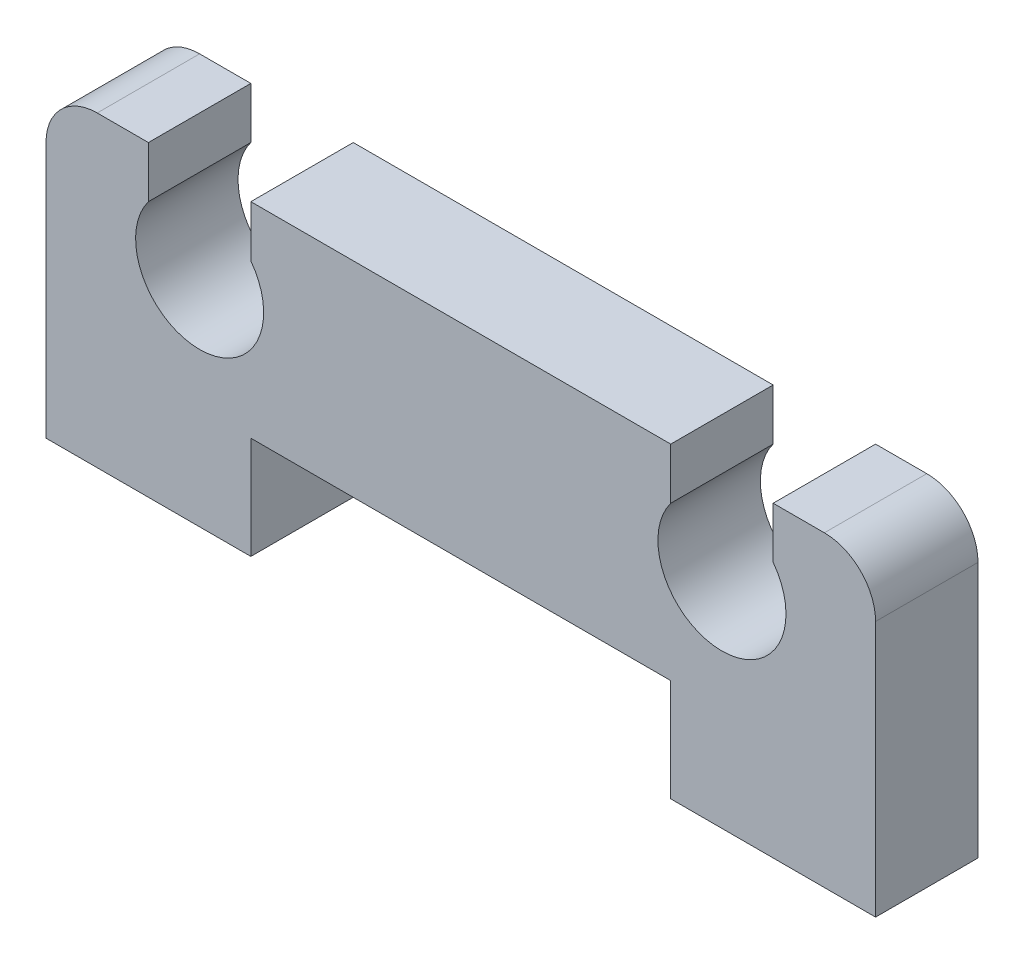
ISO-10303-21;
HEADER;
FILE_DESCRIPTION(('STEP AP214'),'2;1');
FILE_NAME('part.step','',(''),(''),'','','');
FILE_SCHEMA(('AUTOMOTIVE_DESIGN { 1 0 10303 214 1 1 1 1 }'));
ENDSEC;
DATA;
#1=APPLICATION_CONTEXT('core data for automotive mechanical design processes');
#2=APPLICATION_PROTOCOL_DEFINITION('international standard','automotive_design',2000,#1);
#3=PRODUCT_CONTEXT('',#1,'mechanical');
#4=PRODUCT('Part','Part','',(#3));
#5=PRODUCT_RELATED_PRODUCT_CATEGORY('part','',(#4));
#6=PRODUCT_DEFINITION_FORMATION('','',#4);
#7=PRODUCT_DEFINITION_CONTEXT('part definition',#1,'design');
#8=PRODUCT_DEFINITION('design','',#6,#7);
#9=PRODUCT_DEFINITION_SHAPE('','',#8);
#10=(LENGTH_UNIT() NAMED_UNIT(*) SI_UNIT(.MILLI.,.METRE.));
#11=(NAMED_UNIT(*) PLANE_ANGLE_UNIT() SI_UNIT($,.RADIAN.));
#12=(NAMED_UNIT(*) SI_UNIT($,.STERADIAN.) SOLID_ANGLE_UNIT());
#13=UNCERTAINTY_MEASURE_WITH_UNIT(LENGTH_MEASURE(1.E-05),#10,'distance_accuracy_value','');
#14=(GEOMETRIC_REPRESENTATION_CONTEXT(3) GLOBAL_UNCERTAINTY_ASSIGNED_CONTEXT((#13)) GLOBAL_UNIT_ASSIGNED_CONTEXT((#10,
#11,#12)) REPRESENTATION_CONTEXT('',''));
#15=CARTESIAN_POINT('',(0.,0.,0.));
#16=DIRECTION('',(0.,0.,1.));
#17=DIRECTION('',(1.,0.,0.));
#18=AXIS2_PLACEMENT_3D('',#15,#16,#17);
#19=CARTESIAN_POINT('',(4.00000000000054,0.,2.));
#20=DIRECTION('',(-1.,0.,0.));
#21=DIRECTION('',(0.,0.,1.));
#22=AXIS2_PLACEMENT_3D('',#19,#20,#21);
#23=PLANE('',#22);
#24=DIRECTION('',(0.,1.,0.));
#25=VECTOR('',#24,1.);
#26=CARTESIAN_POINT('',(4.00000000000054,0.,0.));
#27=LINE('',#26,#25);
#28=CARTESIAN_POINT('',(4.00000000000054,0.,0.));
#29=VERTEX_POINT('',#28);
#30=CARTESIAN_POINT('',(4.00000000000054,1.99999999999946,0.));
#31=VERTEX_POINT('',#30);
#32=EDGE_CURVE('E189',#29,#31,#27,.T.);
#33=ORIENTED_EDGE('',*,*,#32,.T.);
#34=DIRECTION('',(0.,0.,-1.));
#35=VECTOR('',#34,1.);
#36=CARTESIAN_POINT('',(4.00000000000054,1.99999999999946,2.));
#37=LINE('',#36,#35);
#38=CARTESIAN_POINT('',(4.00000000000054,1.99999999999946,2.));
#39=VERTEX_POINT('',#38);
#40=EDGE_CURVE('E11',#39,#31,#37,.T.);
#41=ORIENTED_EDGE('',*,*,#40,.F.);
#42=DIRECTION('',(0.,1.,0.));
#43=VECTOR('',#42,1.);
#44=CARTESIAN_POINT('',(4.00000000000054,0.,2.));
#45=LINE('',#44,#43);
#46=CARTESIAN_POINT('',(4.00000000000054,0.,2.));
#47=VERTEX_POINT('',#46);
#48=EDGE_CURVE('E223',#47,#39,#45,.T.);
#49=ORIENTED_EDGE('',*,*,#48,.F.);
#50=DIRECTION('',(0.,0.,-1.));
#51=VECTOR('',#50,1.);
#52=CARTESIAN_POINT('',(4.00000000000054,0.,2.));
#53=LINE('',#52,#51);
#54=EDGE_CURVE('E185',#47,#29,#53,.T.);
#55=ORIENTED_EDGE('',*,*,#54,.T.);
#56=EDGE_LOOP('',(#33,#41,#49,#55));
#57=FACE_BOUND('',#56,.T.);
#58=ADVANCED_FACE('F33',(#57),#23,.F.);
#59=CARTESIAN_POINT('',(4.00000000000054,1.99999999999946,2.));
#60=DIRECTION('',(0.,1.,0.));
#61=DIRECTION('',(-1.,0.,0.));
#62=AXIS2_PLACEMENT_3D('',#59,#60,#61);
#63=PLANE('',#62);
#64=DIRECTION('',(1.,0.,0.));
#65=VECTOR('',#64,1.);
#66=CARTESIAN_POINT('',(4.00000000000054,1.99999999999946,0.));
#67=LINE('',#66,#65);
#68=CARTESIAN_POINT('',(12.1999999999995,1.99999999999946,0.));
#69=VERTEX_POINT('',#68);
#70=EDGE_CURVE('E192',#31,#69,#67,.T.);
#71=ORIENTED_EDGE('',*,*,#70,.T.);
#72=DIRECTION('',(0.,0.,-1.));
#73=VECTOR('',#72,1.);
#74=CARTESIAN_POINT('',(12.1999999999995,1.99999999999946,2.));
#75=LINE('',#74,#73);
#76=CARTESIAN_POINT('',(12.1999999999995,1.99999999999946,2.));
#77=VERTEX_POINT('',#76);
#78=EDGE_CURVE('E41',#77,#69,#75,.T.);
#79=ORIENTED_EDGE('',*,*,#78,.F.);
#80=DIRECTION('',(1.,0.,0.));
#81=VECTOR('',#80,1.);
#82=CARTESIAN_POINT('',(4.00000000000054,1.99999999999946,2.));
#83=LINE('',#82,#81);
#84=EDGE_CURVE('E122',#39,#77,#83,.T.);
#85=ORIENTED_EDGE('',*,*,#84,.F.);
#86=ORIENTED_EDGE('',*,*,#40,.T.);
#87=EDGE_LOOP('',(#71,#79,#85,#86));
#88=FACE_BOUND('',#87,.T.);
#89=ADVANCED_FACE('F331',(#88),#63,.F.);
#90=CARTESIAN_POINT('',(12.1999999999995,0.,2.));
#91=DIRECTION('',(1.,0.,0.));
#92=DIRECTION('',(0.,1.,0.));
#93=AXIS2_PLACEMENT_3D('',#90,#91,#92);
#94=PLANE('',#93);
#95=DIRECTION('',(0.,-1.,0.));
#96=VECTOR('',#95,1.);
#97=CARTESIAN_POINT('',(12.1999999999995,0.,0.));
#98=LINE('',#97,#96);
#99=CARTESIAN_POINT('',(12.1999999999995,0.,0.));
#100=VERTEX_POINT('',#99);
#101=EDGE_CURVE('E194',#69,#100,#98,.T.);
#102=ORIENTED_EDGE('',*,*,#101,.T.);
#103=DIRECTION('',(0.,0.,-1.));
#104=VECTOR('',#103,1.);
#105=CARTESIAN_POINT('',(12.1999999999995,0.,2.));
#106=LINE('',#105,#104);
#107=CARTESIAN_POINT('',(12.1999999999995,0.,2.));
#108=VERTEX_POINT('',#107);
#109=EDGE_CURVE('E260',#108,#100,#106,.T.);
#110=ORIENTED_EDGE('',*,*,#109,.F.);
#111=DIRECTION('',(0.,-1.,0.));
#112=VECTOR('',#111,1.);
#113=CARTESIAN_POINT('',(12.1999999999995,0.,2.));
#114=LINE('',#113,#112);
#115=EDGE_CURVE('E268',#77,#108,#114,.T.);
#116=ORIENTED_EDGE('',*,*,#115,.F.);
#117=ORIENTED_EDGE('',*,*,#78,.T.);
#118=EDGE_LOOP('',(#102,#110,#116,#117));
#119=FACE_BOUND('',#118,.T.);
#120=ADVANCED_FACE('F266',(#119),#94,.F.);
#121=CARTESIAN_POINT('',(16.2,0.,2.));
#122=DIRECTION('',(0.,1.,0.));
#123=DIRECTION('',(-1.,0.,0.));
#124=AXIS2_PLACEMENT_3D('',#121,#122,#123);
#125=PLANE('',#124);
#126=DIRECTION('',(1.,0.,0.));
#127=VECTOR('',#126,1.);
#128=CARTESIAN_POINT('',(16.2,0.,0.));
#129=LINE('',#128,#127);
#130=CARTESIAN_POINT('',(16.2,0.,0.));
#131=VERTEX_POINT('',#130);
#132=EDGE_CURVE('E196',#100,#131,#129,.T.);
#133=ORIENTED_EDGE('',*,*,#132,.T.);
#134=DIRECTION('',(0.,0.,-1.));
#135=VECTOR('',#134,1.);
#136=CARTESIAN_POINT('',(16.2,0.,2.));
#137=LINE('',#136,#135);
#138=CARTESIAN_POINT('',(16.2,0.,2.));
#139=VERTEX_POINT('',#138);
#140=EDGE_CURVE('E257',#139,#131,#137,.T.);
#141=ORIENTED_EDGE('',*,*,#140,.F.);
#142=DIRECTION('',(1.,0.,0.));
#143=VECTOR('',#142,1.);
#144=CARTESIAN_POINT('',(16.2,0.,2.));
#145=LINE('',#144,#143);
#146=EDGE_CURVE('E286',#108,#139,#145,.T.);
#147=ORIENTED_EDGE('',*,*,#146,.F.);
#148=ORIENTED_EDGE('',*,*,#109,.T.);
#149=EDGE_LOOP('',(#133,#141,#147,#148));
#150=FACE_BOUND('',#149,.T.);
#151=ADVANCED_FACE('F277',(#150),#125,.F.);
#152=CARTESIAN_POINT('',(16.2,0.,2.));
#153=DIRECTION('',(-1.,0.,0.));
#154=DIRECTION('',(0.,0.,1.));
#155=AXIS2_PLACEMENT_3D('',#152,#153,#154);
#156=PLANE('',#155);
#157=DIRECTION('',(0.,1.,0.));
#158=VECTOR('',#157,1.);
#159=CARTESIAN_POINT('',(16.2,0.,0.));
#160=LINE('',#159,#158);
#161=CARTESIAN_POINT('',(16.2,5.00000000000012,0.));
#162=VERTEX_POINT('',#161);
#163=EDGE_CURVE('E198',#131,#162,#160,.T.);
#164=ORIENTED_EDGE('',*,*,#163,.T.);
#165=DIRECTION('',(0.,0.,-1.));
#166=VECTOR('',#165,1.);
#167=CARTESIAN_POINT('',(16.2,5.00000000000012,2.));
#168=LINE('',#167,#166);
#169=CARTESIAN_POINT('',(16.2,5.00000000000012,2.));
#170=VERTEX_POINT('',#169);
#171=EDGE_CURVE('E254',#170,#162,#168,.T.);
#172=ORIENTED_EDGE('',*,*,#171,.F.);
#173=DIRECTION('',(0.,1.,0.));
#174=VECTOR('',#173,1.);
#175=CARTESIAN_POINT('',(16.2,0.,2.));
#176=LINE('',#175,#174);
#177=EDGE_CURVE('E283',#139,#170,#176,.T.);
#178=ORIENTED_EDGE('',*,*,#177,.F.);
#179=ORIENTED_EDGE('',*,*,#140,.T.);
#180=EDGE_LOOP('',(#164,#172,#178,#179));
#181=FACE_BOUND('',#180,.T.);
#182=ADVANCED_FACE('F281',(#181),#156,.F.);
#183=CARTESIAN_POINT('',(15.2000000000001,5.00000000000012,2.));
#184=DIRECTION('',(0.,0.,-1.));
#185=DIRECTION('',(-1.,0.,0.));
#186=AXIS2_PLACEMENT_3D('',#183,#184,#185);
#187=CYLINDRICAL_SURFACE('',#186,0.99999999999989);
#188=CARTESIAN_POINT('',(15.2000000000001,5.00000000000012,0.));
#189=DIRECTION('',(0.,0.,1.));
#190=DIRECTION('',(-1.,0.,0.));
#191=AXIS2_PLACEMENT_3D('',#188,#189,#190);
#192=CIRCLE('',#191,0.99999999999989);
#193=CARTESIAN_POINT('',(15.2000000000001,6.00000000000001,0.));
#194=VERTEX_POINT('',#193);
#195=EDGE_CURVE('E200',#162,#194,#192,.T.);
#196=ORIENTED_EDGE('',*,*,#195,.T.);
#197=DIRECTION('',(0.,0.,-1.));
#198=VECTOR('',#197,1.);
#199=CARTESIAN_POINT('',(15.2000000000001,6.00000000000001,2.));
#200=LINE('',#199,#198);
#201=CARTESIAN_POINT('',(15.2000000000001,6.00000000000001,2.));
#202=VERTEX_POINT('',#201);
#203=EDGE_CURVE('E251',#202,#194,#200,.T.);
#204=ORIENTED_EDGE('',*,*,#203,.F.);
#205=CARTESIAN_POINT('',(15.2000000000001,5.00000000000012,2.));
#206=DIRECTION('',(0.,0.,1.));
#207=DIRECTION('',(-1.,0.,0.));
#208=AXIS2_PLACEMENT_3D('',#205,#206,#207);
#209=CIRCLE('',#208,0.99999999999989);
#210=EDGE_CURVE('E285',#170,#202,#209,.T.);
#211=ORIENTED_EDGE('',*,*,#210,.F.);
#212=ORIENTED_EDGE('',*,*,#171,.T.);
#213=EDGE_LOOP('',(#196,#204,#211,#212));
#214=FACE_BOUND('',#213,.T.);
#215=ADVANCED_FACE('F344',(#214),#187,.T.);
#216=CARTESIAN_POINT('',(14.2000000000002,6.00000000000001,2.));
#217=DIRECTION('',(0.,-1.,0.));
#218=DIRECTION('',(0.,0.,-1.));
#219=AXIS2_PLACEMENT_3D('',#216,#217,#218);
#220=PLANE('',#219);
#221=DIRECTION('',(-1.,0.,0.));
#222=VECTOR('',#221,1.);
#223=CARTESIAN_POINT('',(14.2000000000002,6.00000000000001,0.));
#224=LINE('',#223,#222);
#225=CARTESIAN_POINT('',(14.2000000000002,6.00000000000001,0.));
#226=VERTEX_POINT('',#225);
#227=EDGE_CURVE('E202',#194,#226,#224,.T.);
#228=ORIENTED_EDGE('',*,*,#227,.T.);
#229=DIRECTION('',(0.,0.,-1.));
#230=VECTOR('',#229,1.);
#231=CARTESIAN_POINT('',(14.2000000000002,6.00000000000001,2.));
#232=LINE('',#231,#230);
#233=CARTESIAN_POINT('',(14.2000000000002,6.00000000000001,2.));
#234=VERTEX_POINT('',#233);
#235=EDGE_CURVE('E248',#234,#226,#232,.T.);
#236=ORIENTED_EDGE('',*,*,#235,.F.);
#237=DIRECTION('',(-1.,0.,0.));
#238=VECTOR('',#237,1.);
#239=CARTESIAN_POINT('',(14.2000000000002,6.00000000000001,2.));
#240=LINE('',#239,#238);
#241=EDGE_CURVE('E288',#202,#234,#240,.T.);
#242=ORIENTED_EDGE('',*,*,#241,.F.);
#243=ORIENTED_EDGE('',*,*,#203,.T.);
#244=EDGE_LOOP('',(#228,#236,#242,#243));
#245=FACE_BOUND('',#244,.T.);
#246=ADVANCED_FACE('F347',(#245),#220,.F.);
#247=CARTESIAN_POINT('',(14.2000000000002,6.00000000000001,2.));
#248=DIRECTION('',(1.,0.,0.));
#249=DIRECTION('',(0.,0.,-1.));
#250=AXIS2_PLACEMENT_3D('',#247,#248,#249);
#251=PLANE('',#250);
#252=DIRECTION('',(0.,-1.,0.));
#253=VECTOR('',#252,1.);
#254=CARTESIAN_POINT('',(14.2000000000002,6.00000000000001,0.));
#255=LINE('',#254,#253);
#256=CARTESIAN_POINT('',(14.2000000000002,5.00000000000012,0.));
#257=VERTEX_POINT('',#256);
#258=EDGE_CURVE('E204',#226,#257,#255,.T.);
#259=ORIENTED_EDGE('',*,*,#258,.T.);
#260=DIRECTION('',(0.,0.,-1.));
#261=VECTOR('',#260,1.);
#262=CARTESIAN_POINT('',(14.2000000000002,5.00000000000012,2.));
#263=LINE('',#262,#261);
#264=CARTESIAN_POINT('',(14.2000000000002,5.00000000000012,2.));
#265=VERTEX_POINT('',#264);
#266=EDGE_CURVE('E245',#265,#257,#263,.T.);
#267=ORIENTED_EDGE('',*,*,#266,.F.);
#268=DIRECTION('',(0.,-1.,0.));
#269=VECTOR('',#268,1.);
#270=CARTESIAN_POINT('',(14.2000000000002,6.00000000000001,2.));
#271=LINE('',#270,#269);
#272=EDGE_CURVE('E294',#234,#265,#271,.T.);
#273=ORIENTED_EDGE('',*,*,#272,.F.);
#274=ORIENTED_EDGE('',*,*,#235,.T.);
#275=EDGE_LOOP('',(#259,#267,#273,#274));
#276=FACE_BOUND('',#275,.T.);
#277=ADVANCED_FACE('F351',(#276),#251,.F.);
#278=CARTESIAN_POINT('',(13.1999999999998,4.25000000000106,2.));
#279=DIRECTION('',(0.,0.,-1.));
#280=DIRECTION('',(-1.,0.,0.));
#281=AXIS2_PLACEMENT_3D('',#278,#279,#280);
#282=CYLINDRICAL_SURFACE('',#281,1.24999999999974);
#283=CARTESIAN_POINT('',(13.1999999999998,4.25000000000106,0.));
#284=DIRECTION('',(0.,0.,-1.));
#285=DIRECTION('',(-1.,0.,0.));
#286=AXIS2_PLACEMENT_3D('',#283,#284,#285);
#287=CIRCLE('',#286,1.24999999999974);
#288=CARTESIAN_POINT('',(12.1999999999995,5.00000000000012,0.));
#289=VERTEX_POINT('',#288);
#290=EDGE_CURVE('E206',#257,#289,#287,.T.);
#291=ORIENTED_EDGE('',*,*,#290,.T.);
#292=DIRECTION('',(0.,0.,-1.));
#293=VECTOR('',#292,1.);
#294=CARTESIAN_POINT('',(12.1999999999995,5.00000000000012,2.));
#295=LINE('',#294,#293);
#296=CARTESIAN_POINT('',(12.1999999999995,5.00000000000012,2.));
#297=VERTEX_POINT('',#296);
#298=EDGE_CURVE('E242',#297,#289,#295,.T.);
#299=ORIENTED_EDGE('',*,*,#298,.F.);
#300=CARTESIAN_POINT('',(13.1999999999998,4.25000000000106,2.));
#301=DIRECTION('',(0.,0.,-1.));
#302=DIRECTION('',(-1.,0.,0.));
#303=AXIS2_PLACEMENT_3D('',#300,#301,#302);
#304=CIRCLE('',#303,1.24999999999974);
#305=EDGE_CURVE('E296',#265,#297,#304,.T.);
#306=ORIENTED_EDGE('',*,*,#305,.F.);
#307=ORIENTED_EDGE('',*,*,#266,.T.);
#308=EDGE_LOOP('',(#291,#299,#306,#307));
#309=FACE_BOUND('',#308,.T.);
#310=ADVANCED_FACE('F355',(#309),#282,.F.);
#311=CARTESIAN_POINT('',(12.1999999999995,6.00000000000001,2.));
#312=DIRECTION('',(-1.,0.,0.));
#313=DIRECTION('',(0.,0.,1.));
#314=AXIS2_PLACEMENT_3D('',#311,#312,#313);
#315=PLANE('',#314);
#316=DIRECTION('',(0.,1.,0.));
#317=VECTOR('',#316,1.);
#318=CARTESIAN_POINT('',(12.1999999999995,6.00000000000001,0.));
#319=LINE('',#318,#317);
#320=CARTESIAN_POINT('',(12.1999999999995,6.00000000000001,0.));
#321=VERTEX_POINT('',#320);
#322=EDGE_CURVE('E208',#289,#321,#319,.T.);
#323=ORIENTED_EDGE('',*,*,#322,.T.);
#324=DIRECTION('',(0.,0.,-1.));
#325=VECTOR('',#324,1.);
#326=CARTESIAN_POINT('',(12.1999999999995,6.00000000000001,2.));
#327=LINE('',#326,#325);
#328=CARTESIAN_POINT('',(12.1999999999995,6.00000000000001,2.));
#329=VERTEX_POINT('',#328);
#330=EDGE_CURVE('E239',#329,#321,#327,.T.);
#331=ORIENTED_EDGE('',*,*,#330,.F.);
#332=DIRECTION('',(0.,1.,0.));
#333=VECTOR('',#332,1.);
#334=CARTESIAN_POINT('',(12.1999999999995,6.00000000000001,2.));
#335=LINE('',#334,#333);
#336=EDGE_CURVE('E298',#297,#329,#335,.T.);
#337=ORIENTED_EDGE('',*,*,#336,.F.);
#338=ORIENTED_EDGE('',*,*,#298,.T.);
#339=EDGE_LOOP('',(#323,#331,#337,#338));
#340=FACE_BOUND('',#339,.T.);
#341=ADVANCED_FACE('F359',(#340),#315,.F.);
#342=CARTESIAN_POINT('',(4.00000000000054,6.00000000000001,2.));
#343=DIRECTION('',(0.,-1.,0.));
#344=DIRECTION('',(1.,0.,0.));
#345=AXIS2_PLACEMENT_3D('',#342,#343,#344);
#346=PLANE('',#345);
#347=DIRECTION('',(-1.,0.,0.));
#348=VECTOR('',#347,1.);
#349=CARTESIAN_POINT('',(4.00000000000054,6.00000000000001,0.));
#350=LINE('',#349,#348);
#351=CARTESIAN_POINT('',(4.00000000000054,6.00000000000001,0.));
#352=VERTEX_POINT('',#351);
#353=EDGE_CURVE('E210',#321,#352,#350,.T.);
#354=ORIENTED_EDGE('',*,*,#353,.T.);
#355=DIRECTION('',(0.,0.,-1.));
#356=VECTOR('',#355,1.);
#357=CARTESIAN_POINT('',(4.00000000000054,6.00000000000001,2.));
#358=LINE('',#357,#356);
#359=CARTESIAN_POINT('',(4.00000000000054,6.00000000000001,2.));
#360=VERTEX_POINT('',#359);
#361=EDGE_CURVE('E236',#360,#352,#358,.T.);
#362=ORIENTED_EDGE('',*,*,#361,.F.);
#363=DIRECTION('',(-1.,0.,0.));
#364=VECTOR('',#363,1.);
#365=CARTESIAN_POINT('',(4.00000000000054,6.00000000000001,2.));
#366=LINE('',#365,#364);
#367=EDGE_CURVE('E300',#329,#360,#366,.T.);
#368=ORIENTED_EDGE('',*,*,#367,.F.);
#369=ORIENTED_EDGE('',*,*,#330,.T.);
#370=EDGE_LOOP('',(#354,#362,#368,#369));
#371=FACE_BOUND('',#370,.T.);
#372=ADVANCED_FACE('F363',(#371),#346,.F.);
#373=CARTESIAN_POINT('',(4.00000000000054,6.00000000000001,2.));
#374=DIRECTION('',(1.,0.,0.));
#375=DIRECTION('',(0.,1.,0.));
#376=AXIS2_PLACEMENT_3D('',#373,#374,#375);
#377=PLANE('',#376);
#378=DIRECTION('',(0.,-1.,0.));
#379=VECTOR('',#378,1.);
#380=CARTESIAN_POINT('',(4.00000000000054,6.00000000000001,0.));
#381=LINE('',#380,#379);
#382=CARTESIAN_POINT('',(4.00000000000055,5.00000000000012,0.));
#383=VERTEX_POINT('',#382);
#384=EDGE_CURVE('E212',#352,#383,#381,.T.);
#385=ORIENTED_EDGE('',*,*,#384,.T.);
#386=DIRECTION('',(0.,0.,-1.));
#387=VECTOR('',#386,1.);
#388=CARTESIAN_POINT('',(4.00000000000055,5.00000000000012,2.));
#389=LINE('',#388,#387);
#390=CARTESIAN_POINT('',(4.00000000000055,5.00000000000012,2.));
#391=VERTEX_POINT('',#390);
#392=EDGE_CURVE('E233',#391,#383,#389,.T.);
#393=ORIENTED_EDGE('',*,*,#392,.F.);
#394=DIRECTION('',(0.,-1.,0.));
#395=VECTOR('',#394,1.);
#396=CARTESIAN_POINT('',(4.00000000000054,6.00000000000001,2.));
#397=LINE('',#396,#395);
#398=EDGE_CURVE('E302',#360,#391,#397,.T.);
#399=ORIENTED_EDGE('',*,*,#398,.F.);
#400=ORIENTED_EDGE('',*,*,#361,.T.);
#401=EDGE_LOOP('',(#385,#393,#399,#400));
#402=FACE_BOUND('',#401,.T.);
#403=ADVANCED_FACE('F367',(#402),#377,.F.);
#404=CARTESIAN_POINT('',(3.00000000000016,4.25000000000105,2.));
#405=DIRECTION('',(0.,0.,-1.));
#406=DIRECTION('',(-1.,0.,0.));
#407=AXIS2_PLACEMENT_3D('',#404,#405,#406);
#408=CYLINDRICAL_SURFACE('',#407,1.24999999999974);
#409=CARTESIAN_POINT('',(3.00000000000016,4.25000000000105,0.));
#410=DIRECTION('',(0.,0.,-1.));
#411=DIRECTION('',(1.,0.,0.));
#412=AXIS2_PLACEMENT_3D('',#409,#410,#411);
#413=CIRCLE('',#412,1.24999999999974);
#414=CARTESIAN_POINT('',(1.99999999999978,5.00000000000012,0.));
#415=VERTEX_POINT('',#414);
#416=EDGE_CURVE('E214',#383,#415,#413,.T.);
#417=ORIENTED_EDGE('',*,*,#416,.T.);
#418=DIRECTION('',(0.,0.,-1.));
#419=VECTOR('',#418,1.);
#420=CARTESIAN_POINT('',(1.99999999999978,5.00000000000012,2.));
#421=LINE('',#420,#419);
#422=CARTESIAN_POINT('',(1.99999999999978,5.00000000000012,2.));
#423=VERTEX_POINT('',#422);
#424=EDGE_CURVE('E230',#423,#415,#421,.T.);
#425=ORIENTED_EDGE('',*,*,#424,.F.);
#426=CARTESIAN_POINT('',(3.00000000000016,4.25000000000105,2.));
#427=DIRECTION('',(0.,0.,-1.));
#428=DIRECTION('',(1.,0.,0.));
#429=AXIS2_PLACEMENT_3D('',#426,#427,#428);
#430=CIRCLE('',#429,1.24999999999974);
#431=EDGE_CURVE('E304',#391,#423,#430,.T.);
#432=ORIENTED_EDGE('',*,*,#431,.F.);
#433=ORIENTED_EDGE('',*,*,#392,.T.);
#434=EDGE_LOOP('',(#417,#425,#432,#433));
#435=FACE_BOUND('',#434,.T.);
#436=ADVANCED_FACE('F371',(#435),#408,.F.);
#437=CARTESIAN_POINT('',(1.99999999999978,6.00000000000001,2.));
#438=DIRECTION('',(-1.,0.,0.));
#439=DIRECTION('',(0.,-1.,0.));
#440=AXIS2_PLACEMENT_3D('',#437,#438,#439);
#441=PLANE('',#440);
#442=DIRECTION('',(0.,1.,0.));
#443=VECTOR('',#442,1.);
#444=CARTESIAN_POINT('',(1.99999999999978,6.00000000000001,0.));
#445=LINE('',#444,#443);
#446=CARTESIAN_POINT('',(1.99999999999978,6.00000000000001,0.));
#447=VERTEX_POINT('',#446);
#448=EDGE_CURVE('E216',#415,#447,#445,.T.);
#449=ORIENTED_EDGE('',*,*,#448,.T.);
#450=DIRECTION('',(0.,0.,-1.));
#451=VECTOR('',#450,1.);
#452=CARTESIAN_POINT('',(1.99999999999978,6.00000000000001,2.));
#453=LINE('',#452,#451);
#454=CARTESIAN_POINT('',(1.99999999999978,6.00000000000001,2.));
#455=VERTEX_POINT('',#454);
#456=EDGE_CURVE('E227',#455,#447,#453,.T.);
#457=ORIENTED_EDGE('',*,*,#456,.F.);
#458=DIRECTION('',(0.,1.,0.));
#459=VECTOR('',#458,1.);
#460=CARTESIAN_POINT('',(1.99999999999978,6.00000000000001,2.));
#461=LINE('',#460,#459);
#462=EDGE_CURVE('E306',#423,#455,#461,.T.);
#463=ORIENTED_EDGE('',*,*,#462,.F.);
#464=ORIENTED_EDGE('',*,*,#424,.T.);
#465=EDGE_LOOP('',(#449,#457,#463,#464));
#466=FACE_BOUND('',#465,.T.);
#467=ADVANCED_FACE('F312',(#466),#441,.F.);
#468=CARTESIAN_POINT('',(1.99999999999978,6.00000000000001,2.));
#469=DIRECTION('',(0.,-1.,0.));
#470=DIRECTION('',(0.,0.,-1.));
#471=AXIS2_PLACEMENT_3D('',#468,#469,#470);
#472=PLANE('',#471);
#473=DIRECTION('',(-1.,0.,0.));
#474=VECTOR('',#473,1.);
#475=CARTESIAN_POINT('',(1.99999999999978,6.00000000000001,0.));
#476=LINE('',#475,#474);
#477=CARTESIAN_POINT('',(0.99999999999989,6.00000000000001,0.));
#478=VERTEX_POINT('',#477);
#479=EDGE_CURVE('E218',#447,#478,#476,.T.);
#480=ORIENTED_EDGE('',*,*,#479,.T.);
#481=DIRECTION('',(0.,0.,-1.));
#482=VECTOR('',#481,1.);
#483=CARTESIAN_POINT('',(0.99999999999989,6.00000000000001,2.));
#484=LINE('',#483,#482);
#485=CARTESIAN_POINT('',(0.99999999999989,6.00000000000001,2.));
#486=VERTEX_POINT('',#485);
#487=EDGE_CURVE('E180',#486,#478,#484,.T.);
#488=ORIENTED_EDGE('',*,*,#487,.F.);
#489=DIRECTION('',(-1.,0.,0.));
#490=VECTOR('',#489,1.);
#491=CARTESIAN_POINT('',(1.99999999999978,6.00000000000001,2.));
#492=LINE('',#491,#490);
#493=EDGE_CURVE('E171',#455,#486,#492,.T.);
#494=ORIENTED_EDGE('',*,*,#493,.F.);
#495=ORIENTED_EDGE('',*,*,#456,.T.);
#496=EDGE_LOOP('',(#480,#488,#494,#495));
#497=FACE_BOUND('',#496,.T.);
#498=ADVANCED_FACE('F316',(#497),#472,.F.);
#499=CARTESIAN_POINT('',(0.99999999999989,5.00000000000012,2.));
#500=DIRECTION('',(0.,0.,-1.));
#501=DIRECTION('',(-1.,0.,0.));
#502=AXIS2_PLACEMENT_3D('',#499,#500,#501);
#503=CYLINDRICAL_SURFACE('',#502,0.99999999999989);
#504=CARTESIAN_POINT('',(0.99999999999989,5.00000000000012,0.));
#505=DIRECTION('',(0.,0.,1.));
#506=DIRECTION('',(1.,0.,0.));
#507=AXIS2_PLACEMENT_3D('',#504,#505,#506);
#508=CIRCLE('',#507,0.99999999999989);
#509=CARTESIAN_POINT('',(0.,5.00000000000012,0.));
#510=VERTEX_POINT('',#509);
#511=EDGE_CURVE('E179',#478,#510,#508,.T.);
#512=ORIENTED_EDGE('',*,*,#511,.T.);
#513=DIRECTION('',(0.,0.,-1.));
#514=VECTOR('',#513,1.);
#515=CARTESIAN_POINT('',(0.,5.00000000000012,2.));
#516=LINE('',#515,#514);
#517=CARTESIAN_POINT('',(0.,5.00000000000012,2.));
#518=VERTEX_POINT('',#517);
#519=EDGE_CURVE('E176',#518,#510,#516,.T.);
#520=ORIENTED_EDGE('',*,*,#519,.F.);
#521=CARTESIAN_POINT('',(0.99999999999989,5.00000000000012,2.));
#522=DIRECTION('',(0.,0.,1.));
#523=DIRECTION('',(1.,0.,0.));
#524=AXIS2_PLACEMENT_3D('',#521,#522,#523);
#525=CIRCLE('',#524,0.99999999999989);
#526=EDGE_CURVE('E165',#486,#518,#525,.T.);
#527=ORIENTED_EDGE('',*,*,#526,.F.);
#528=ORIENTED_EDGE('',*,*,#487,.T.);
#529=EDGE_LOOP('',(#512,#520,#527,#528));
#530=FACE_BOUND('',#529,.T.);
#531=ADVANCED_FACE('F177',(#530),#503,.T.);
#532=CARTESIAN_POINT('',(0.,0.,2.));
#533=DIRECTION('',(1.,0.,0.));
#534=DIRECTION('',(0.,0.,-1.));
#535=AXIS2_PLACEMENT_3D('',#532,#533,#534);
#536=PLANE('',#535);
#537=DIRECTION('',(0.,-1.,0.));
#538=VECTOR('',#537,1.);
#539=CARTESIAN_POINT('',(0.,0.,0.));
#540=LINE('',#539,#538);
#541=CARTESIAN_POINT('',(0.,0.,0.));
#542=VERTEX_POINT('',#541);
#543=EDGE_CURVE('E108',#510,#542,#540,.T.);
#544=ORIENTED_EDGE('',*,*,#543,.T.);
#545=DIRECTION('',(0.,0.,-1.));
#546=VECTOR('',#545,1.);
#547=CARTESIAN_POINT('',(0.,0.,2.));
#548=LINE('',#547,#546);
#549=CARTESIAN_POINT('',(0.,0.,2.));
#550=VERTEX_POINT('',#549);
#551=EDGE_CURVE('E181',#550,#542,#548,.T.);
#552=ORIENTED_EDGE('',*,*,#551,.F.);
#553=DIRECTION('',(0.,-1.,0.));
#554=VECTOR('',#553,1.);
#555=CARTESIAN_POINT('',(0.,0.,2.));
#556=LINE('',#555,#554);
#557=EDGE_CURVE('E169',#518,#550,#556,.T.);
#558=ORIENTED_EDGE('',*,*,#557,.F.);
#559=ORIENTED_EDGE('',*,*,#519,.T.);
#560=EDGE_LOOP('',(#544,#552,#558,#559));
#561=FACE_BOUND('',#560,.T.);
#562=ADVANCED_FACE('F183',(#561),#536,.F.);
#563=CARTESIAN_POINT('',(0.,0.,2.));
#564=DIRECTION('',(0.,1.,0.));
#565=DIRECTION('',(0.,0.,1.));
#566=AXIS2_PLACEMENT_3D('',#563,#564,#565);
#567=PLANE('',#566);
#568=DIRECTION('',(1.,0.,0.));
#569=VECTOR('',#568,1.);
#570=CARTESIAN_POINT('',(0.,0.,0.));
#571=LINE('',#570,#569);
#572=EDGE_CURVE('E114',#542,#29,#571,.T.);
#573=ORIENTED_EDGE('',*,*,#572,.T.);
#574=ORIENTED_EDGE('',*,*,#54,.F.);
#575=DIRECTION('',(1.,0.,0.));
#576=VECTOR('',#575,1.);
#577=CARTESIAN_POINT('',(0.,0.,2.));
#578=LINE('',#577,#576);
#579=EDGE_CURVE('E49',#550,#47,#578,.T.);
#580=ORIENTED_EDGE('',*,*,#579,.F.);
#581=ORIENTED_EDGE('',*,*,#551,.T.);
#582=EDGE_LOOP('',(#573,#574,#580,#581));
#583=FACE_BOUND('',#582,.T.);
#584=ADVANCED_FACE('F320',(#583),#567,.F.);
#585=CARTESIAN_POINT('',(15.2000000000001,5.00000000000012,2.));
#586=DIRECTION('',(0.,0.,-1.));
#587=DIRECTION('',(-1.,0.,0.));
#588=AXIS2_PLACEMENT_3D('',#585,#586,#587);
#589=PLANE('',#588);
#590=ORIENTED_EDGE('',*,*,#48,.T.);
#591=ORIENTED_EDGE('',*,*,#84,.T.);
#592=ORIENTED_EDGE('',*,*,#115,.T.);
#593=ORIENTED_EDGE('',*,*,#146,.T.);
#594=ORIENTED_EDGE('',*,*,#177,.T.);
#595=ORIENTED_EDGE('',*,*,#210,.T.);
#596=ORIENTED_EDGE('',*,*,#241,.T.);
#597=ORIENTED_EDGE('',*,*,#272,.T.);
#598=ORIENTED_EDGE('',*,*,#305,.T.);
#599=ORIENTED_EDGE('',*,*,#336,.T.);
#600=ORIENTED_EDGE('',*,*,#367,.T.);
#601=ORIENTED_EDGE('',*,*,#398,.T.);
#602=ORIENTED_EDGE('',*,*,#431,.T.);
#603=ORIENTED_EDGE('',*,*,#462,.T.);
#604=ORIENTED_EDGE('',*,*,#493,.T.);
#605=ORIENTED_EDGE('',*,*,#526,.T.);
#606=ORIENTED_EDGE('',*,*,#557,.T.);
#607=ORIENTED_EDGE('',*,*,#579,.T.);
#608=EDGE_LOOP('',(#590,#591,#592,#593,#594,#595,#596,#597,#598,#599,#600,#601,#602,#603,#604,
#605,#606,#607));
#609=FACE_BOUND('',#608,.T.);
#610=ADVANCED_FACE('F167',(#609),#589,.F.);
#611=CARTESIAN_POINT('',(15.2000000000001,5.00000000000012,0.));
#612=DIRECTION('',(0.,0.,-1.));
#613=DIRECTION('',(-1.,0.,0.));
#614=AXIS2_PLACEMENT_3D('',#611,#612,#613);
#615=PLANE('',#614);
#616=ORIENTED_EDGE('',*,*,#32,.F.);
#617=ORIENTED_EDGE('',*,*,#572,.F.);
#618=ORIENTED_EDGE('',*,*,#543,.F.);
#619=ORIENTED_EDGE('',*,*,#511,.F.);
#620=ORIENTED_EDGE('',*,*,#479,.F.);
#621=ORIENTED_EDGE('',*,*,#448,.F.);
#622=ORIENTED_EDGE('',*,*,#416,.F.);
#623=ORIENTED_EDGE('',*,*,#384,.F.);
#624=ORIENTED_EDGE('',*,*,#353,.F.);
#625=ORIENTED_EDGE('',*,*,#322,.F.);
#626=ORIENTED_EDGE('',*,*,#290,.F.);
#627=ORIENTED_EDGE('',*,*,#258,.F.);
#628=ORIENTED_EDGE('',*,*,#227,.F.);
#629=ORIENTED_EDGE('',*,*,#195,.F.);
#630=ORIENTED_EDGE('',*,*,#163,.F.);
#631=ORIENTED_EDGE('',*,*,#132,.F.);
#632=ORIENTED_EDGE('',*,*,#101,.F.);
#633=ORIENTED_EDGE('',*,*,#70,.F.);
#634=EDGE_LOOP('',(#616,#617,#618,#619,#620,#621,#622,#623,#624,#625,#626,#627,#628,#629,#630,
#631,#632,#633));
#635=FACE_BOUND('',#634,.T.);
#636=ADVANCED_FACE('F272',(#635),#615,.T.);
#637=CLOSED_SHELL('',(#58,#89,#120,#151,#182,#215,#246,#277,#310,#341,#372,#403,#436,#467,#498,
#531,#562,#584,#610,#636));
#638=MANIFOLD_SOLID_BREP('B2',#637);
#639=ADVANCED_BREP_SHAPE_REPRESENTATION('',(#18,#638),#14);
#640=SHAPE_DEFINITION_REPRESENTATION(#9,#639);
ENDSEC;
END-ISO-10303-21;
